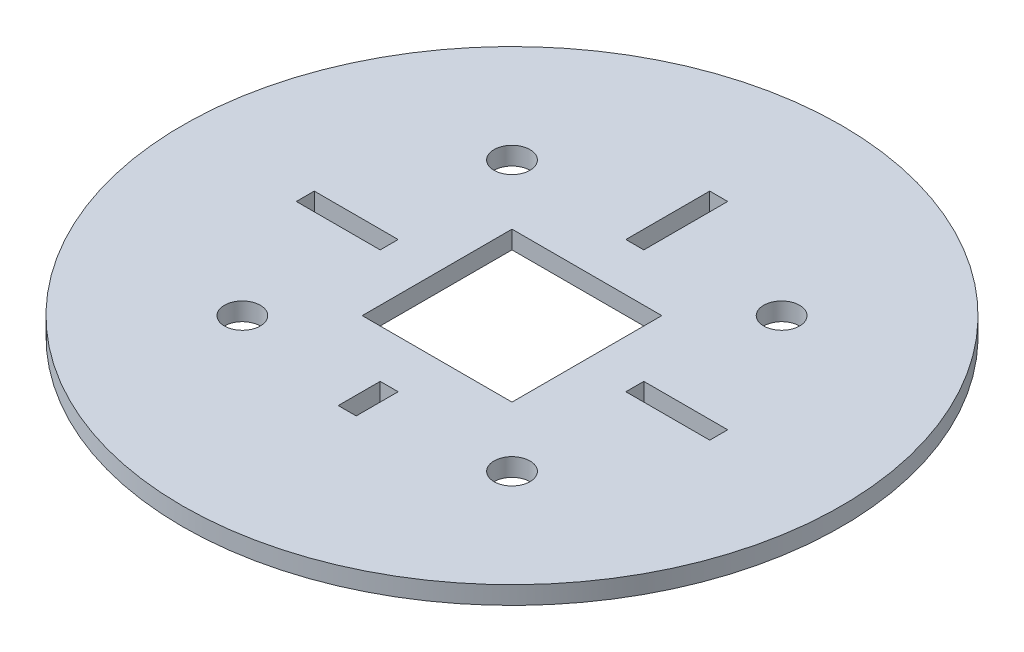
ISO-10303-21;
HEADER;
FILE_DESCRIPTION(('STEP AP214'),'2;1');
FILE_NAME('part.step','',(''),(''),'','','');
FILE_SCHEMA(('AUTOMOTIVE_DESIGN { 1 0 10303 214 1 1 1 1 }'));
ENDSEC;
DATA;
#1=APPLICATION_CONTEXT('core data for automotive mechanical design processes');
#2=APPLICATION_PROTOCOL_DEFINITION('international standard','automotive_design',2000,#1);
#3=PRODUCT_CONTEXT('',#1,'mechanical');
#4=PRODUCT('Part','Part','',(#3));
#5=PRODUCT_RELATED_PRODUCT_CATEGORY('part','',(#4));
#6=PRODUCT_DEFINITION_FORMATION('','',#4);
#7=PRODUCT_DEFINITION_CONTEXT('part definition',#1,'design');
#8=PRODUCT_DEFINITION('design','',#6,#7);
#9=PRODUCT_DEFINITION_SHAPE('','',#8);
#10=(LENGTH_UNIT() NAMED_UNIT(*) SI_UNIT(.MILLI.,.METRE.));
#11=(NAMED_UNIT(*) PLANE_ANGLE_UNIT() SI_UNIT($,.RADIAN.));
#12=(NAMED_UNIT(*) SI_UNIT($,.STERADIAN.) SOLID_ANGLE_UNIT());
#13=UNCERTAINTY_MEASURE_WITH_UNIT(LENGTH_MEASURE(1.E-05),#10,'distance_accuracy_value','');
#14=(GEOMETRIC_REPRESENTATION_CONTEXT(3) GLOBAL_UNCERTAINTY_ASSIGNED_CONTEXT((#13)) GLOBAL_UNIT_ASSIGNED_CONTEXT((#10,
#11,#12)) REPRESENTATION_CONTEXT('',''));
#15=CARTESIAN_POINT('',(0.,0.,0.));
#16=DIRECTION('',(0.,0.,1.));
#17=DIRECTION('',(1.,0.,0.));
#18=AXIS2_PLACEMENT_3D('',#15,#16,#17);
#19=CARTESIAN_POINT('',(0.,3.,0.));
#20=DIRECTION('',(0.,-1.,0.));
#21=DIRECTION('',(0.,0.,-1.));
#22=AXIS2_PLACEMENT_3D('',#19,#20,#21);
#23=CYLINDRICAL_SURFACE('',#22,55.);
#24=CARTESIAN_POINT('',(0.,3.,0.));
#25=DIRECTION('',(0.,1.,0.));
#26=DIRECTION('',(0.,0.,1.));
#27=AXIS2_PLACEMENT_3D('',#24,#25,#26);
#28=CIRCLE('',#27,55.);
#29=CARTESIAN_POINT('',(0.,3.,55.));
#30=VERTEX_POINT('',#29);
#31=EDGE_CURVE('E11',#30,#30,#28,.T.);
#32=ORIENTED_EDGE('',*,*,#31,.F.);
#33=EDGE_LOOP('',(#32));
#34=FACE_BOUND('',#33,.T.);
#35=CARTESIAN_POINT('',(0.,0.,0.));
#36=DIRECTION('',(0.,1.,0.));
#37=DIRECTION('',(0.,0.,1.));
#38=AXIS2_PLACEMENT_3D('',#35,#36,#37);
#39=CIRCLE('',#38,55.);
#40=CARTESIAN_POINT('',(0.,0.,55.));
#41=VERTEX_POINT('',#40);
#42=EDGE_CURVE('E35',#41,#41,#39,.T.);
#43=ORIENTED_EDGE('',*,*,#42,.T.);
#44=EDGE_LOOP('',(#43));
#45=FACE_BOUND('',#44,.T.);
#46=ADVANCED_FACE('F32',(#34,#45),#23,.T.);
#47=CARTESIAN_POINT('',(0.,3.,0.));
#48=DIRECTION('',(0.,1.,0.));
#49=DIRECTION('',(0.,0.,1.));
#50=AXIS2_PLACEMENT_3D('',#47,#48,#49);
#51=PLANE('',#50);
#52=CARTESIAN_POINT('',(-22.5,3.,22.5));
#53=DIRECTION('',(0.,1.,0.));
#54=DIRECTION('',(0.,0.,-1.));
#55=AXIS2_PLACEMENT_3D('',#52,#53,#54);
#56=CIRCLE('',#55,3.);
#57=CARTESIAN_POINT('',(-22.5,3.,19.5));
#58=VERTEX_POINT('',#57);
#59=EDGE_CURVE('E223',#58,#58,#56,.T.);
#60=ORIENTED_EDGE('',*,*,#59,.F.);
#61=EDGE_LOOP('',(#60));
#62=FACE_BOUND('',#61,.T.);
#63=CARTESIAN_POINT('',(22.5,3.,22.5));
#64=DIRECTION('',(0.,1.,0.));
#65=DIRECTION('',(0.,0.,1.));
#66=AXIS2_PLACEMENT_3D('',#63,#64,#65);
#67=CIRCLE('',#66,3.);
#68=CARTESIAN_POINT('',(22.5,3.,25.5));
#69=VERTEX_POINT('',#68);
#70=EDGE_CURVE('E217',#69,#69,#67,.T.);
#71=ORIENTED_EDGE('',*,*,#70,.F.);
#72=EDGE_LOOP('',(#71));
#73=FACE_BOUND('',#72,.T.);
#74=CARTESIAN_POINT('',(22.5,3.,-22.5));
#75=DIRECTION('',(0.,1.,0.));
#76=DIRECTION('',(0.,0.,-1.));
#77=AXIS2_PLACEMENT_3D('',#74,#75,#76);
#78=CIRCLE('',#77,3.);
#79=CARTESIAN_POINT('',(22.5,3.,-25.5));
#80=VERTEX_POINT('',#79);
#81=EDGE_CURVE('E211',#80,#80,#78,.T.);
#82=ORIENTED_EDGE('',*,*,#81,.F.);
#83=EDGE_LOOP('',(#82));
#84=FACE_BOUND('',#83,.T.);
#85=DIRECTION('',(0.,0.,-1.));
#86=VECTOR('',#85,1.);
#87=CARTESIAN_POINT('',(34.5,3.,-1.5));
#88=LINE('',#87,#86);
#89=CARTESIAN_POINT('',(34.5,3.,1.5));
#90=VERTEX_POINT('',#89);
#91=CARTESIAN_POINT('',(34.5,3.,-1.5));
#92=VERTEX_POINT('',#91);
#93=EDGE_CURVE('E46',#90,#92,#88,.T.);
#94=ORIENTED_EDGE('',*,*,#93,.F.);
#95=DIRECTION('',(1.,0.,0.));
#96=VECTOR('',#95,1.);
#97=CARTESIAN_POINT('',(20.5,3.,1.5));
#98=LINE('',#97,#96);
#99=CARTESIAN_POINT('',(20.5,3.,1.5));
#100=VERTEX_POINT('',#99);
#101=EDGE_CURVE('E189',#100,#90,#98,.T.);
#102=ORIENTED_EDGE('',*,*,#101,.F.);
#103=DIRECTION('',(0.,0.,1.));
#104=VECTOR('',#103,1.);
#105=CARTESIAN_POINT('',(20.5,3.,-1.5));
#106=LINE('',#105,#104);
#107=CARTESIAN_POINT('',(20.5,3.,-1.5));
#108=VERTEX_POINT('',#107);
#109=EDGE_CURVE('E192',#108,#100,#106,.T.);
#110=ORIENTED_EDGE('',*,*,#109,.F.);
#111=DIRECTION('',(-1.,0.,0.));
#112=VECTOR('',#111,1.);
#113=CARTESIAN_POINT('',(20.5,3.,-1.5));
#114=LINE('',#113,#112);
#115=EDGE_CURVE('E198',#92,#108,#114,.T.);
#116=ORIENTED_EDGE('',*,*,#115,.F.);
#117=EDGE_LOOP('',(#94,#102,#110,#116));
#118=FACE_BOUND('',#117,.T.);
#119=DIRECTION('',(0.,0.,1.));
#120=VECTOR('',#119,1.);
#121=CARTESIAN_POINT('',(-12.5,3.,-12.5));
#122=LINE('',#121,#120);
#123=CARTESIAN_POINT('',(-12.5,3.,-12.5));
#124=VERTEX_POINT('',#123);
#125=CARTESIAN_POINT('',(-12.5,3.,12.5));
#126=VERTEX_POINT('',#125);
#127=EDGE_CURVE('E54',#124,#126,#122,.T.);
#128=ORIENTED_EDGE('',*,*,#127,.F.);
#129=DIRECTION('',(-1.,0.,0.));
#130=VECTOR('',#129,1.);
#131=CARTESIAN_POINT('',(12.5,3.,-12.5));
#132=LINE('',#131,#130);
#133=CARTESIAN_POINT('',(12.5,3.,-12.5));
#134=VERTEX_POINT('',#133);
#135=EDGE_CURVE('E294',#134,#124,#132,.T.);
#136=ORIENTED_EDGE('',*,*,#135,.F.);
#137=DIRECTION('',(0.,0.,-1.));
#138=VECTOR('',#137,1.);
#139=CARTESIAN_POINT('',(12.5,3.,-12.5));
#140=LINE('',#139,#138);
#141=CARTESIAN_POINT('',(12.5,3.,12.5));
#142=VERTEX_POINT('',#141);
#143=EDGE_CURVE('E309',#142,#134,#140,.T.);
#144=ORIENTED_EDGE('',*,*,#143,.F.);
#145=DIRECTION('',(1.,0.,0.));
#146=VECTOR('',#145,1.);
#147=CARTESIAN_POINT('',(12.5,3.,12.5));
#148=LINE('',#147,#146);
#149=EDGE_CURVE('E305',#126,#142,#148,.T.);
#150=ORIENTED_EDGE('',*,*,#149,.F.);
#151=EDGE_LOOP('',(#128,#136,#144,#150));
#152=FACE_BOUND('',#151,.T.);
#153=CARTESIAN_POINT('',(-22.5,3.,-22.5));
#154=DIRECTION('',(0.,1.,0.));
#155=DIRECTION('',(0.,0.,1.));
#156=AXIS2_PLACEMENT_3D('',#153,#154,#155);
#157=CIRCLE('',#156,3.);
#158=CARTESIAN_POINT('',(-22.5,3.,-19.5));
#159=VERTEX_POINT('',#158);
#160=EDGE_CURVE('E253',#159,#159,#157,.T.);
#161=ORIENTED_EDGE('',*,*,#160,.F.);
#162=EDGE_LOOP('',(#161));
#163=FACE_BOUND('',#162,.T.);
#164=DIRECTION('',(0.,0.,-1.));
#165=VECTOR('',#164,1.);
#166=CARTESIAN_POINT('',(1.49999999999998,3.,20.5));
#167=LINE('',#166,#165);
#168=CARTESIAN_POINT('',(1.49999999999998,3.,27.5));
#169=VERTEX_POINT('',#168);
#170=CARTESIAN_POINT('',(1.49999999999998,3.,20.5));
#171=VERTEX_POINT('',#170);
#172=EDGE_CURVE('E240',#169,#171,#167,.T.);
#173=ORIENTED_EDGE('',*,*,#172,.F.);
#174=DIRECTION('',(1.,0.,0.));
#175=VECTOR('',#174,1.);
#176=CARTESIAN_POINT('',(-1.49999999999998,3.,27.5));
#177=LINE('',#176,#175);
#178=CARTESIAN_POINT('',(-1.49999999999998,3.,27.5));
#179=VERTEX_POINT('',#178);
#180=EDGE_CURVE('E230',#179,#169,#177,.T.);
#181=ORIENTED_EDGE('',*,*,#180,.F.);
#182=DIRECTION('',(0.,0.,1.));
#183=VECTOR('',#182,1.);
#184=CARTESIAN_POINT('',(-1.49999999999998,3.,20.5));
#185=LINE('',#184,#183);
#186=CARTESIAN_POINT('',(-1.49999999999998,3.,20.5));
#187=VERTEX_POINT('',#186);
#188=EDGE_CURVE('E246',#187,#179,#185,.T.);
#189=ORIENTED_EDGE('',*,*,#188,.F.);
#190=DIRECTION('',(-1.,0.,0.));
#191=VECTOR('',#190,1.);
#192=CARTESIAN_POINT('',(-1.49999999999998,3.,20.5));
#193=LINE('',#192,#191);
#194=EDGE_CURVE('E242',#171,#187,#193,.T.);
#195=ORIENTED_EDGE('',*,*,#194,.F.);
#196=EDGE_LOOP('',(#173,#181,#189,#195));
#197=FACE_BOUND('',#196,.T.);
#198=DIRECTION('',(0.,0.,-1.));
#199=VECTOR('',#198,1.);
#200=CARTESIAN_POINT('',(-20.5,3.,-1.5));
#201=LINE('',#200,#199);
#202=CARTESIAN_POINT('',(-20.5,3.,1.49999999999999));
#203=VERTEX_POINT('',#202);
#204=CARTESIAN_POINT('',(-20.5,3.,-1.5));
#205=VERTEX_POINT('',#204);
#206=EDGE_CURVE('E205',#203,#205,#201,.T.);
#207=ORIENTED_EDGE('',*,*,#206,.F.);
#208=DIRECTION('',(1.,0.,0.));
#209=VECTOR('',#208,1.);
#210=CARTESIAN_POINT('',(-34.5,3.,1.49999999999999));
#211=LINE('',#210,#209);
#212=CARTESIAN_POINT('',(-34.5,3.,1.49999999999999));
#213=VERTEX_POINT('',#212);
#214=EDGE_CURVE('E264',#213,#203,#211,.T.);
#215=ORIENTED_EDGE('',*,*,#214,.F.);
#216=DIRECTION('',(0.,0.,1.));
#217=VECTOR('',#216,1.);
#218=CARTESIAN_POINT('',(-34.5,3.,-1.5));
#219=LINE('',#218,#217);
#220=CARTESIAN_POINT('',(-34.5,3.,-1.5));
#221=VERTEX_POINT('',#220);
#222=EDGE_CURVE('E278',#221,#213,#219,.T.);
#223=ORIENTED_EDGE('',*,*,#222,.F.);
#224=DIRECTION('',(-1.,0.,0.));
#225=VECTOR('',#224,1.);
#226=CARTESIAN_POINT('',(-34.5,3.,-1.5));
#227=LINE('',#226,#225);
#228=EDGE_CURVE('E275',#205,#221,#227,.T.);
#229=ORIENTED_EDGE('',*,*,#228,.F.);
#230=EDGE_LOOP('',(#207,#215,#223,#229));
#231=FACE_BOUND('',#230,.T.);
#232=DIRECTION('',(-1.,0.,0.));
#233=VECTOR('',#232,1.);
#234=CARTESIAN_POINT('',(-1.50000000000001,3.,-34.5));
#235=LINE('',#234,#233);
#236=CARTESIAN_POINT('',(1.49999999999998,3.,-34.5));
#237=VERTEX_POINT('',#236);
#238=CARTESIAN_POINT('',(-1.50000000000001,3.,-34.5));
#239=VERTEX_POINT('',#238);
#240=EDGE_CURVE('E316',#237,#239,#235,.T.);
#241=ORIENTED_EDGE('',*,*,#240,.F.);
#242=DIRECTION('',(0.,0.,-1.));
#243=VECTOR('',#242,1.);
#244=CARTESIAN_POINT('',(1.49999999999998,3.,-34.5));
#245=LINE('',#244,#243);
#246=CARTESIAN_POINT('',(1.49999999999998,3.,-20.5));
#247=VERTEX_POINT('',#246);
#248=EDGE_CURVE('E330',#247,#237,#245,.T.);
#249=ORIENTED_EDGE('',*,*,#248,.F.);
#250=DIRECTION('',(1.,0.,0.));
#251=VECTOR('',#250,1.);
#252=CARTESIAN_POINT('',(-1.50000000000001,3.,-20.5));
#253=LINE('',#252,#251);
#254=CARTESIAN_POINT('',(-1.50000000000001,3.,-20.5));
#255=VERTEX_POINT('',#254);
#256=EDGE_CURVE('E344',#255,#247,#253,.T.);
#257=ORIENTED_EDGE('',*,*,#256,.F.);
#258=DIRECTION('',(0.,0.,1.));
#259=VECTOR('',#258,1.);
#260=CARTESIAN_POINT('',(-1.50000000000001,3.,-34.5));
#261=LINE('',#260,#259);
#262=EDGE_CURVE('E341',#239,#255,#261,.T.);
#263=ORIENTED_EDGE('',*,*,#262,.F.);
#264=EDGE_LOOP('',(#241,#249,#257,#263));
#265=FACE_BOUND('',#264,.T.);
#266=ORIENTED_EDGE('',*,*,#31,.T.);
#267=EDGE_LOOP('',(#266));
#268=FACE_BOUND('',#267,.T.);
#269=ADVANCED_FACE('F366',(#62,#73,#84,#118,#152,#163,#197,#231,#265,#268),#51,.T.);
#270=CARTESIAN_POINT('',(0.,0.,0.));
#271=DIRECTION('',(0.,1.,0.));
#272=DIRECTION('',(0.,0.,1.));
#273=AXIS2_PLACEMENT_3D('',#270,#271,#272);
#274=PLANE('',#273);
#275=CARTESIAN_POINT('',(-22.5,0.,22.5));
#276=DIRECTION('',(0.,1.,0.));
#277=DIRECTION('',(0.,0.,-1.));
#278=AXIS2_PLACEMENT_3D('',#275,#276,#277);
#279=CIRCLE('',#278,3.);
#280=CARTESIAN_POINT('',(-22.5,0.,19.5));
#281=VERTEX_POINT('',#280);
#282=EDGE_CURVE('E220',#281,#281,#279,.T.);
#283=ORIENTED_EDGE('',*,*,#282,.T.);
#284=EDGE_LOOP('',(#283));
#285=FACE_BOUND('',#284,.T.);
#286=CARTESIAN_POINT('',(22.5,0.,22.5));
#287=DIRECTION('',(0.,1.,0.));
#288=DIRECTION('',(0.,0.,1.));
#289=AXIS2_PLACEMENT_3D('',#286,#287,#288);
#290=CIRCLE('',#289,3.);
#291=CARTESIAN_POINT('',(22.5,0.,25.5));
#292=VERTEX_POINT('',#291);
#293=EDGE_CURVE('E214',#292,#292,#290,.T.);
#294=ORIENTED_EDGE('',*,*,#293,.T.);
#295=EDGE_LOOP('',(#294));
#296=FACE_BOUND('',#295,.T.);
#297=CARTESIAN_POINT('',(22.5,0.,-22.5));
#298=DIRECTION('',(0.,1.,0.));
#299=DIRECTION('',(0.,0.,-1.));
#300=AXIS2_PLACEMENT_3D('',#297,#298,#299);
#301=CIRCLE('',#300,3.);
#302=CARTESIAN_POINT('',(22.5,0.,-25.5));
#303=VERTEX_POINT('',#302);
#304=EDGE_CURVE('E199',#303,#303,#301,.T.);
#305=ORIENTED_EDGE('',*,*,#304,.T.);
#306=EDGE_LOOP('',(#305));
#307=FACE_BOUND('',#306,.T.);
#308=DIRECTION('',(1.,0.,0.));
#309=VECTOR('',#308,1.);
#310=CARTESIAN_POINT('',(20.5,0.,1.5));
#311=LINE('',#310,#309);
#312=CARTESIAN_POINT('',(20.5,0.,1.5));
#313=VERTEX_POINT('',#312);
#314=CARTESIAN_POINT('',(34.5,0.,1.5));
#315=VERTEX_POINT('',#314);
#316=EDGE_CURVE('E176',#313,#315,#311,.T.);
#317=ORIENTED_EDGE('',*,*,#316,.T.);
#318=DIRECTION('',(0.,0.,-1.));
#319=VECTOR('',#318,1.);
#320=CARTESIAN_POINT('',(34.5,0.,-1.5));
#321=LINE('',#320,#319);
#322=CARTESIAN_POINT('',(34.5,0.,-1.5));
#323=VERTEX_POINT('',#322);
#324=EDGE_CURVE('E170',#315,#323,#321,.T.);
#325=ORIENTED_EDGE('',*,*,#324,.T.);
#326=DIRECTION('',(-1.,0.,0.));
#327=VECTOR('',#326,1.);
#328=CARTESIAN_POINT('',(20.5,0.,-1.5));
#329=LINE('',#328,#327);
#330=CARTESIAN_POINT('',(20.5,0.,-1.5));
#331=VERTEX_POINT('',#330);
#332=EDGE_CURVE('E180',#323,#331,#329,.T.);
#333=ORIENTED_EDGE('',*,*,#332,.T.);
#334=DIRECTION('',(0.,0.,1.));
#335=VECTOR('',#334,1.);
#336=CARTESIAN_POINT('',(20.5,0.,-1.5));
#337=LINE('',#336,#335);
#338=EDGE_CURVE('E184',#331,#313,#337,.T.);
#339=ORIENTED_EDGE('',*,*,#338,.T.);
#340=EDGE_LOOP('',(#317,#325,#333,#339));
#341=FACE_BOUND('',#340,.T.);
#342=DIRECTION('',(-1.,0.,0.));
#343=VECTOR('',#342,1.);
#344=CARTESIAN_POINT('',(12.5,0.,-12.5));
#345=LINE('',#344,#343);
#346=CARTESIAN_POINT('',(12.5,0.,-12.5));
#347=VERTEX_POINT('',#346);
#348=CARTESIAN_POINT('',(-12.5,0.,-12.5));
#349=VERTEX_POINT('',#348);
#350=EDGE_CURVE('E300',#347,#349,#345,.T.);
#351=ORIENTED_EDGE('',*,*,#350,.T.);
#352=DIRECTION('',(0.,0.,1.));
#353=VECTOR('',#352,1.);
#354=CARTESIAN_POINT('',(-12.5,0.,-12.5));
#355=LINE('',#354,#353);
#356=CARTESIAN_POINT('',(-12.5,0.,12.5));
#357=VERTEX_POINT('',#356);
#358=EDGE_CURVE('E290',#349,#357,#355,.T.);
#359=ORIENTED_EDGE('',*,*,#358,.T.);
#360=DIRECTION('',(1.,0.,0.));
#361=VECTOR('',#360,1.);
#362=CARTESIAN_POINT('',(12.5,0.,12.5));
#363=LINE('',#362,#361);
#364=CARTESIAN_POINT('',(12.5,0.,12.5));
#365=VERTEX_POINT('',#364);
#366=EDGE_CURVE('E293',#357,#365,#363,.T.);
#367=ORIENTED_EDGE('',*,*,#366,.T.);
#368=DIRECTION('',(0.,0.,-1.));
#369=VECTOR('',#368,1.);
#370=CARTESIAN_POINT('',(12.5,0.,-12.5));
#371=LINE('',#370,#369);
#372=EDGE_CURVE('E297',#365,#347,#371,.T.);
#373=ORIENTED_EDGE('',*,*,#372,.T.);
#374=EDGE_LOOP('',(#351,#359,#367,#373));
#375=FACE_BOUND('',#374,.T.);
#376=CARTESIAN_POINT('',(-22.5,0.,-22.5));
#377=DIRECTION('',(0.,1.,0.));
#378=DIRECTION('',(0.,0.,1.));
#379=AXIS2_PLACEMENT_3D('',#376,#377,#378);
#380=CIRCLE('',#379,3.);
#381=CARTESIAN_POINT('',(-22.5,0.,-19.5));
#382=VERTEX_POINT('',#381);
#383=EDGE_CURVE('E306',#382,#382,#380,.T.);
#384=ORIENTED_EDGE('',*,*,#383,.T.);
#385=EDGE_LOOP('',(#384));
#386=FACE_BOUND('',#385,.T.);
#387=DIRECTION('',(1.,0.,0.));
#388=VECTOR('',#387,1.);
#389=CARTESIAN_POINT('',(-1.49999999999998,0.,27.5));
#390=LINE('',#389,#388);
#391=CARTESIAN_POINT('',(-1.49999999999998,0.,27.5));
#392=VERTEX_POINT('',#391);
#393=CARTESIAN_POINT('',(1.49999999999998,0.,27.5));
#394=VERTEX_POINT('',#393);
#395=EDGE_CURVE('E236',#392,#394,#390,.T.);
#396=ORIENTED_EDGE('',*,*,#395,.T.);
#397=DIRECTION('',(0.,0.,-1.));
#398=VECTOR('',#397,1.);
#399=CARTESIAN_POINT('',(1.49999999999998,0.,20.5));
#400=LINE('',#399,#398);
#401=CARTESIAN_POINT('',(1.49999999999998,0.,20.5));
#402=VERTEX_POINT('',#401);
#403=EDGE_CURVE('E226',#394,#402,#400,.T.);
#404=ORIENTED_EDGE('',*,*,#403,.T.);
#405=DIRECTION('',(-1.,0.,0.));
#406=VECTOR('',#405,1.);
#407=CARTESIAN_POINT('',(-1.49999999999998,0.,20.5));
#408=LINE('',#407,#406);
#409=CARTESIAN_POINT('',(-1.49999999999998,0.,20.5));
#410=VERTEX_POINT('',#409);
#411=EDGE_CURVE('E229',#402,#410,#408,.T.);
#412=ORIENTED_EDGE('',*,*,#411,.T.);
#413=DIRECTION('',(0.,0.,1.));
#414=VECTOR('',#413,1.);
#415=CARTESIAN_POINT('',(-1.49999999999998,0.,20.5));
#416=LINE('',#415,#414);
#417=EDGE_CURVE('E233',#410,#392,#416,.T.);
#418=ORIENTED_EDGE('',*,*,#417,.T.);
#419=EDGE_LOOP('',(#396,#404,#412,#418));
#420=FACE_BOUND('',#419,.T.);
#421=DIRECTION('',(1.,0.,0.));
#422=VECTOR('',#421,1.);
#423=CARTESIAN_POINT('',(-34.5,0.,1.49999999999999));
#424=LINE('',#423,#422);
#425=CARTESIAN_POINT('',(-34.5,0.,1.49999999999999));
#426=VERTEX_POINT('',#425);
#427=CARTESIAN_POINT('',(-20.5,0.,1.49999999999999));
#428=VERTEX_POINT('',#427);
#429=EDGE_CURVE('E270',#426,#428,#424,.T.);
#430=ORIENTED_EDGE('',*,*,#429,.T.);
#431=DIRECTION('',(0.,0.,-1.));
#432=VECTOR('',#431,1.);
#433=CARTESIAN_POINT('',(-20.5,0.,-1.5));
#434=LINE('',#433,#432);
#435=CARTESIAN_POINT('',(-20.5,0.,-1.5));
#436=VERTEX_POINT('',#435);
#437=EDGE_CURVE('E260',#428,#436,#434,.T.);
#438=ORIENTED_EDGE('',*,*,#437,.T.);
#439=DIRECTION('',(-1.,0.,0.));
#440=VECTOR('',#439,1.);
#441=CARTESIAN_POINT('',(-34.5,0.,-1.5));
#442=LINE('',#441,#440);
#443=CARTESIAN_POINT('',(-34.5,0.,-1.5));
#444=VERTEX_POINT('',#443);
#445=EDGE_CURVE('E263',#436,#444,#442,.T.);
#446=ORIENTED_EDGE('',*,*,#445,.T.);
#447=DIRECTION('',(0.,0.,1.));
#448=VECTOR('',#447,1.);
#449=CARTESIAN_POINT('',(-34.5,0.,-1.5));
#450=LINE('',#449,#448);
#451=EDGE_CURVE('E267',#444,#426,#450,.T.);
#452=ORIENTED_EDGE('',*,*,#451,.T.);
#453=EDGE_LOOP('',(#430,#438,#446,#452));
#454=FACE_BOUND('',#453,.T.);
#455=DIRECTION('',(0.,0.,-1.));
#456=VECTOR('',#455,1.);
#457=CARTESIAN_POINT('',(1.49999999999998,0.,-34.5));
#458=LINE('',#457,#456);
#459=CARTESIAN_POINT('',(1.49999999999998,0.,-20.5));
#460=VERTEX_POINT('',#459);
#461=CARTESIAN_POINT('',(1.49999999999998,0.,-34.5));
#462=VERTEX_POINT('',#461);
#463=EDGE_CURVE('E336',#460,#462,#458,.T.);
#464=ORIENTED_EDGE('',*,*,#463,.T.);
#465=DIRECTION('',(-1.,0.,0.));
#466=VECTOR('',#465,1.);
#467=CARTESIAN_POINT('',(-1.50000000000001,0.,-34.5));
#468=LINE('',#467,#466);
#469=CARTESIAN_POINT('',(-1.50000000000001,0.,-34.5));
#470=VERTEX_POINT('',#469);
#471=EDGE_CURVE('E326',#462,#470,#468,.T.);
#472=ORIENTED_EDGE('',*,*,#471,.T.);
#473=DIRECTION('',(0.,0.,1.));
#474=VECTOR('',#473,1.);
#475=CARTESIAN_POINT('',(-1.50000000000001,0.,-34.5));
#476=LINE('',#475,#474);
#477=CARTESIAN_POINT('',(-1.50000000000001,0.,-20.5));
#478=VERTEX_POINT('',#477);
#479=EDGE_CURVE('E329',#470,#478,#476,.T.);
#480=ORIENTED_EDGE('',*,*,#479,.T.);
#481=DIRECTION('',(1.,0.,0.));
#482=VECTOR('',#481,1.);
#483=CARTESIAN_POINT('',(-1.50000000000001,0.,-20.5));
#484=LINE('',#483,#482);
#485=EDGE_CURVE('E333',#478,#460,#484,.T.);
#486=ORIENTED_EDGE('',*,*,#485,.T.);
#487=EDGE_LOOP('',(#464,#472,#480,#486));
#488=FACE_BOUND('',#487,.T.);
#489=ORIENTED_EDGE('',*,*,#42,.F.);
#490=EDGE_LOOP('',(#489));
#491=FACE_BOUND('',#490,.T.);
#492=ADVANCED_FACE('F186',(#285,#296,#307,#341,#375,#386,#420,#454,#488,#491),#274,.F.);
#493=CARTESIAN_POINT('',(-1.50000000000001,0.,-34.5));
#494=DIRECTION('',(0.,0.,-1.));
#495=DIRECTION('',(-1.,0.,0.));
#496=AXIS2_PLACEMENT_3D('',#493,#494,#495);
#497=PLANE('',#496);
#498=ORIENTED_EDGE('',*,*,#240,.T.);
#499=DIRECTION('',(0.,1.,0.));
#500=VECTOR('',#499,1.);
#501=CARTESIAN_POINT('',(-1.50000000000001,0.,-34.5));
#502=LINE('',#501,#500);
#503=EDGE_CURVE('E339',#470,#239,#502,.T.);
#504=ORIENTED_EDGE('',*,*,#503,.F.);
#505=ORIENTED_EDGE('',*,*,#471,.F.);
#506=DIRECTION('',(0.,1.,0.));
#507=VECTOR('',#506,1.);
#508=CARTESIAN_POINT('',(1.49999999999998,0.,-34.5));
#509=LINE('',#508,#507);
#510=EDGE_CURVE('E349',#462,#237,#509,.T.);
#511=ORIENTED_EDGE('',*,*,#510,.T.);
#512=EDGE_LOOP('',(#498,#504,#505,#511));
#513=FACE_BOUND('',#512,.T.);
#514=ADVANCED_FACE('F374',(#513),#497,.F.);
#515=CARTESIAN_POINT('',(1.49999999999998,0.,-34.5));
#516=DIRECTION('',(1.,0.,0.));
#517=DIRECTION('',(0.,0.,-1.));
#518=AXIS2_PLACEMENT_3D('',#515,#516,#517);
#519=PLANE('',#518);
#520=ORIENTED_EDGE('',*,*,#248,.T.);
#521=ORIENTED_EDGE('',*,*,#510,.F.);
#522=ORIENTED_EDGE('',*,*,#463,.F.);
#523=DIRECTION('',(0.,1.,0.));
#524=VECTOR('',#523,1.);
#525=CARTESIAN_POINT('',(1.49999999999998,0.,-20.5));
#526=LINE('',#525,#524);
#527=EDGE_CURVE('E351',#460,#247,#526,.T.);
#528=ORIENTED_EDGE('',*,*,#527,.T.);
#529=EDGE_LOOP('',(#520,#521,#522,#528));
#530=FACE_BOUND('',#529,.T.);
#531=ADVANCED_FACE('F376',(#530),#519,.F.);
#532=CARTESIAN_POINT('',(-1.50000000000001,0.,-20.5));
#533=DIRECTION('',(0.,0.,1.));
#534=DIRECTION('',(1.,0.,0.));
#535=AXIS2_PLACEMENT_3D('',#532,#533,#534);
#536=PLANE('',#535);
#537=ORIENTED_EDGE('',*,*,#256,.T.);
#538=ORIENTED_EDGE('',*,*,#527,.F.);
#539=ORIENTED_EDGE('',*,*,#485,.F.);
#540=DIRECTION('',(0.,1.,0.));
#541=VECTOR('',#540,1.);
#542=CARTESIAN_POINT('',(-1.50000000000001,0.,-20.5));
#543=LINE('',#542,#541);
#544=EDGE_CURVE('E353',#478,#255,#543,.T.);
#545=ORIENTED_EDGE('',*,*,#544,.T.);
#546=EDGE_LOOP('',(#537,#538,#539,#545));
#547=FACE_BOUND('',#546,.T.);
#548=ADVANCED_FACE('F370',(#547),#536,.F.);
#549=CARTESIAN_POINT('',(-1.50000000000001,0.,-34.5));
#550=DIRECTION('',(-1.,0.,0.));
#551=DIRECTION('',(0.,0.,1.));
#552=AXIS2_PLACEMENT_3D('',#549,#550,#551);
#553=PLANE('',#552);
#554=ORIENTED_EDGE('',*,*,#262,.T.);
#555=ORIENTED_EDGE('',*,*,#544,.F.);
#556=ORIENTED_EDGE('',*,*,#479,.F.);
#557=ORIENTED_EDGE('',*,*,#503,.T.);
#558=EDGE_LOOP('',(#554,#555,#556,#557));
#559=FACE_BOUND('',#558,.T.);
#560=ADVANCED_FACE('F359',(#559),#553,.F.);
#561=CARTESIAN_POINT('',(-20.5,0.,-1.5));
#562=DIRECTION('',(1.,0.,0.));
#563=DIRECTION('',(0.,0.,-1.));
#564=AXIS2_PLACEMENT_3D('',#561,#562,#563);
#565=PLANE('',#564);
#566=ORIENTED_EDGE('',*,*,#206,.T.);
#567=DIRECTION('',(0.,1.,0.));
#568=VECTOR('',#567,1.);
#569=CARTESIAN_POINT('',(-20.5,0.,-1.5));
#570=LINE('',#569,#568);
#571=EDGE_CURVE('E273',#436,#205,#570,.T.);
#572=ORIENTED_EDGE('',*,*,#571,.F.);
#573=ORIENTED_EDGE('',*,*,#437,.F.);
#574=DIRECTION('',(0.,1.,0.));
#575=VECTOR('',#574,1.);
#576=CARTESIAN_POINT('',(-20.5,0.,1.49999999999999));
#577=LINE('',#576,#575);
#578=EDGE_CURVE('E243',#428,#203,#577,.T.);
#579=ORIENTED_EDGE('',*,*,#578,.T.);
#580=EDGE_LOOP('',(#566,#572,#573,#579));
#581=FACE_BOUND('',#580,.T.);
#582=ADVANCED_FACE('F404',(#581),#565,.F.);
#583=CARTESIAN_POINT('',(-34.5,0.,1.49999999999999));
#584=DIRECTION('',(0.,0.,1.));
#585=DIRECTION('',(1.,0.,0.));
#586=AXIS2_PLACEMENT_3D('',#583,#584,#585);
#587=PLANE('',#586);
#588=ORIENTED_EDGE('',*,*,#214,.T.);
#589=ORIENTED_EDGE('',*,*,#578,.F.);
#590=ORIENTED_EDGE('',*,*,#429,.F.);
#591=DIRECTION('',(0.,1.,0.));
#592=VECTOR('',#591,1.);
#593=CARTESIAN_POINT('',(-34.5,0.,1.49999999999999));
#594=LINE('',#593,#592);
#595=EDGE_CURVE('E284',#426,#213,#594,.T.);
#596=ORIENTED_EDGE('',*,*,#595,.T.);
#597=EDGE_LOOP('',(#588,#589,#590,#596));
#598=FACE_BOUND('',#597,.T.);
#599=ADVANCED_FACE('F408',(#598),#587,.F.);
#600=CARTESIAN_POINT('',(-34.5,0.,-1.5));
#601=DIRECTION('',(-1.,0.,0.));
#602=DIRECTION('',(0.,0.,1.));
#603=AXIS2_PLACEMENT_3D('',#600,#601,#602);
#604=PLANE('',#603);
#605=ORIENTED_EDGE('',*,*,#222,.T.);
#606=ORIENTED_EDGE('',*,*,#595,.F.);
#607=ORIENTED_EDGE('',*,*,#451,.F.);
#608=DIRECTION('',(0.,1.,0.));
#609=VECTOR('',#608,1.);
#610=CARTESIAN_POINT('',(-34.5,0.,-1.5));
#611=LINE('',#610,#609);
#612=EDGE_CURVE('E286',#444,#221,#611,.T.);
#613=ORIENTED_EDGE('',*,*,#612,.T.);
#614=EDGE_LOOP('',(#605,#606,#607,#613));
#615=FACE_BOUND('',#614,.T.);
#616=ADVANCED_FACE('F414',(#615),#604,.F.);
#617=CARTESIAN_POINT('',(-34.5,0.,-1.5));
#618=DIRECTION('',(0.,0.,-1.));
#619=DIRECTION('',(-1.,0.,0.));
#620=AXIS2_PLACEMENT_3D('',#617,#618,#619);
#621=PLANE('',#620);
#622=ORIENTED_EDGE('',*,*,#228,.T.);
#623=ORIENTED_EDGE('',*,*,#612,.F.);
#624=ORIENTED_EDGE('',*,*,#445,.F.);
#625=ORIENTED_EDGE('',*,*,#571,.T.);
#626=EDGE_LOOP('',(#622,#623,#624,#625));
#627=FACE_BOUND('',#626,.T.);
#628=ADVANCED_FACE('F419',(#627),#621,.F.);
#629=CARTESIAN_POINT('',(1.49999999999998,0.,20.5));
#630=DIRECTION('',(1.,0.,0.));
#631=DIRECTION('',(0.,0.,-1.));
#632=AXIS2_PLACEMENT_3D('',#629,#630,#631);
#633=PLANE('',#632);
#634=ORIENTED_EDGE('',*,*,#172,.T.);
#635=DIRECTION('',(0.,1.,0.));
#636=VECTOR('',#635,1.);
#637=CARTESIAN_POINT('',(1.49999999999998,0.,20.5));
#638=LINE('',#637,#636);
#639=EDGE_CURVE('E239',#402,#171,#638,.T.);
#640=ORIENTED_EDGE('',*,*,#639,.F.);
#641=ORIENTED_EDGE('',*,*,#403,.F.);
#642=DIRECTION('',(0.,1.,0.));
#643=VECTOR('',#642,1.);
#644=CARTESIAN_POINT('',(1.49999999999998,0.,27.5));
#645=LINE('',#644,#643);
#646=EDGE_CURVE('E251',#394,#169,#645,.T.);
#647=ORIENTED_EDGE('',*,*,#646,.T.);
#648=EDGE_LOOP('',(#634,#640,#641,#647));
#649=FACE_BOUND('',#648,.T.);
#650=ADVANCED_FACE('F469',(#649),#633,.F.);
#651=CARTESIAN_POINT('',(-1.49999999999998,0.,27.5));
#652=DIRECTION('',(0.,0.,1.));
#653=DIRECTION('',(1.,0.,0.));
#654=AXIS2_PLACEMENT_3D('',#651,#652,#653);
#655=PLANE('',#654);
#656=ORIENTED_EDGE('',*,*,#180,.T.);
#657=ORIENTED_EDGE('',*,*,#646,.F.);
#658=ORIENTED_EDGE('',*,*,#395,.F.);
#659=DIRECTION('',(0.,1.,0.));
#660=VECTOR('',#659,1.);
#661=CARTESIAN_POINT('',(-1.49999999999998,0.,27.5));
#662=LINE('',#661,#660);
#663=EDGE_CURVE('E254',#392,#179,#662,.T.);
#664=ORIENTED_EDGE('',*,*,#663,.T.);
#665=EDGE_LOOP('',(#656,#657,#658,#664));
#666=FACE_BOUND('',#665,.T.);
#667=ADVANCED_FACE('F472',(#666),#655,.F.);
#668=CARTESIAN_POINT('',(-1.49999999999998,0.,20.5));
#669=DIRECTION('',(-1.,0.,0.));
#670=DIRECTION('',(0.,0.,1.));
#671=AXIS2_PLACEMENT_3D('',#668,#669,#670);
#672=PLANE('',#671);
#673=ORIENTED_EDGE('',*,*,#188,.T.);
#674=ORIENTED_EDGE('',*,*,#663,.F.);
#675=ORIENTED_EDGE('',*,*,#417,.F.);
#676=DIRECTION('',(0.,1.,0.));
#677=VECTOR('',#676,1.);
#678=CARTESIAN_POINT('',(-1.49999999999998,0.,20.5));
#679=LINE('',#678,#677);
#680=EDGE_CURVE('E256',#410,#187,#679,.T.);
#681=ORIENTED_EDGE('',*,*,#680,.T.);
#682=EDGE_LOOP('',(#673,#674,#675,#681));
#683=FACE_BOUND('',#682,.T.);
#684=ADVANCED_FACE('F442',(#683),#672,.F.);
#685=CARTESIAN_POINT('',(-1.49999999999998,0.,20.5));
#686=DIRECTION('',(0.,0.,-1.));
#687=DIRECTION('',(-1.,0.,0.));
#688=AXIS2_PLACEMENT_3D('',#685,#686,#687);
#689=PLANE('',#688);
#690=ORIENTED_EDGE('',*,*,#194,.T.);
#691=ORIENTED_EDGE('',*,*,#680,.F.);
#692=ORIENTED_EDGE('',*,*,#411,.F.);
#693=ORIENTED_EDGE('',*,*,#639,.T.);
#694=EDGE_LOOP('',(#690,#691,#692,#693));
#695=FACE_BOUND('',#694,.T.);
#696=ADVANCED_FACE('F437',(#695),#689,.F.);
#697=CARTESIAN_POINT('',(-22.5,0.,-22.5));
#698=DIRECTION('',(0.,1.,0.));
#699=DIRECTION('',(0.,0.,1.));
#700=AXIS2_PLACEMENT_3D('',#697,#698,#699);
#701=CYLINDRICAL_SURFACE('',#700,3.);
#702=ORIENTED_EDGE('',*,*,#383,.F.);
#703=EDGE_LOOP('',(#702));
#704=FACE_BOUND('',#703,.T.);
#705=ORIENTED_EDGE('',*,*,#160,.T.);
#706=EDGE_LOOP('',(#705));
#707=FACE_BOUND('',#706,.T.);
#708=ADVANCED_FACE('F435',(#704,#707),#701,.F.);
#709=CARTESIAN_POINT('',(-12.5,0.,-12.5));
#710=DIRECTION('',(-1.,0.,0.));
#711=DIRECTION('',(0.,0.,1.));
#712=AXIS2_PLACEMENT_3D('',#709,#710,#711);
#713=PLANE('',#712);
#714=ORIENTED_EDGE('',*,*,#127,.T.);
#715=DIRECTION('',(0.,1.,0.));
#716=VECTOR('',#715,1.);
#717=CARTESIAN_POINT('',(-12.5,0.,12.5));
#718=LINE('',#717,#716);
#719=EDGE_CURVE('E303',#357,#126,#718,.T.);
#720=ORIENTED_EDGE('',*,*,#719,.F.);
#721=ORIENTED_EDGE('',*,*,#358,.F.);
#722=DIRECTION('',(0.,1.,0.));
#723=VECTOR('',#722,1.);
#724=CARTESIAN_POINT('',(-12.5,0.,-12.5));
#725=LINE('',#724,#723);
#726=EDGE_CURVE('E314',#349,#124,#725,.T.);
#727=ORIENTED_EDGE('',*,*,#726,.T.);
#728=EDGE_LOOP('',(#714,#720,#721,#727));
#729=FACE_BOUND('',#728,.T.);
#730=ADVANCED_FACE('F425',(#729),#713,.F.);
#731=CARTESIAN_POINT('',(12.5,0.,-12.5));
#732=DIRECTION('',(0.,0.,-1.));
#733=DIRECTION('',(-1.,0.,0.));
#734=AXIS2_PLACEMENT_3D('',#731,#732,#733);
#735=PLANE('',#734);
#736=ORIENTED_EDGE('',*,*,#135,.T.);
#737=ORIENTED_EDGE('',*,*,#726,.F.);
#738=ORIENTED_EDGE('',*,*,#350,.F.);
#739=DIRECTION('',(0.,1.,0.));
#740=VECTOR('',#739,1.);
#741=CARTESIAN_POINT('',(12.5,0.,-12.5));
#742=LINE('',#741,#740);
#743=EDGE_CURVE('E317',#347,#134,#742,.T.);
#744=ORIENTED_EDGE('',*,*,#743,.T.);
#745=EDGE_LOOP('',(#736,#737,#738,#744));
#746=FACE_BOUND('',#745,.T.);
#747=ADVANCED_FACE('F421',(#746),#735,.F.);
#748=CARTESIAN_POINT('',(12.5,0.,-12.5));
#749=DIRECTION('',(1.,0.,0.));
#750=DIRECTION('',(0.,0.,-1.));
#751=AXIS2_PLACEMENT_3D('',#748,#749,#750);
#752=PLANE('',#751);
#753=ORIENTED_EDGE('',*,*,#143,.T.);
#754=ORIENTED_EDGE('',*,*,#743,.F.);
#755=ORIENTED_EDGE('',*,*,#372,.F.);
#756=DIRECTION('',(0.,1.,0.));
#757=VECTOR('',#756,1.);
#758=CARTESIAN_POINT('',(12.5,0.,12.5));
#759=LINE('',#758,#757);
#760=EDGE_CURVE('E319',#365,#142,#759,.T.);
#761=ORIENTED_EDGE('',*,*,#760,.T.);
#762=EDGE_LOOP('',(#753,#754,#755,#761));
#763=FACE_BOUND('',#762,.T.);
#764=ADVANCED_FACE('F424',(#763),#752,.F.);
#765=CARTESIAN_POINT('',(12.5,0.,12.5));
#766=DIRECTION('',(0.,0.,1.));
#767=DIRECTION('',(1.,0.,0.));
#768=AXIS2_PLACEMENT_3D('',#765,#766,#767);
#769=PLANE('',#768);
#770=ORIENTED_EDGE('',*,*,#149,.T.);
#771=ORIENTED_EDGE('',*,*,#760,.F.);
#772=ORIENTED_EDGE('',*,*,#366,.F.);
#773=ORIENTED_EDGE('',*,*,#719,.T.);
#774=EDGE_LOOP('',(#770,#771,#772,#773));
#775=FACE_BOUND('',#774,.T.);
#776=ADVANCED_FACE('F429',(#775),#769,.F.);
#777=CARTESIAN_POINT('',(34.5,0.,-1.5));
#778=DIRECTION('',(1.,0.,0.));
#779=DIRECTION('',(0.,0.,-1.));
#780=AXIS2_PLACEMENT_3D('',#777,#778,#779);
#781=PLANE('',#780);
#782=ORIENTED_EDGE('',*,*,#93,.T.);
#783=DIRECTION('',(0.,1.,0.));
#784=VECTOR('',#783,1.);
#785=CARTESIAN_POINT('',(34.5,0.,-1.5));
#786=LINE('',#785,#784);
#787=EDGE_CURVE('E166',#323,#92,#786,.T.);
#788=ORIENTED_EDGE('',*,*,#787,.F.);
#789=ORIENTED_EDGE('',*,*,#324,.F.);
#790=DIRECTION('',(0.,1.,0.));
#791=VECTOR('',#790,1.);
#792=CARTESIAN_POINT('',(34.5,0.,1.5));
#793=LINE('',#792,#791);
#794=EDGE_CURVE('E203',#315,#90,#793,.T.);
#795=ORIENTED_EDGE('',*,*,#794,.T.);
#796=EDGE_LOOP('',(#782,#788,#789,#795));
#797=FACE_BOUND('',#796,.T.);
#798=ADVANCED_FACE('F168',(#797),#781,.F.);
#799=CARTESIAN_POINT('',(20.5,0.,1.5));
#800=DIRECTION('',(0.,0.,1.));
#801=DIRECTION('',(1.,0.,0.));
#802=AXIS2_PLACEMENT_3D('',#799,#800,#801);
#803=PLANE('',#802);
#804=ORIENTED_EDGE('',*,*,#101,.T.);
#805=ORIENTED_EDGE('',*,*,#794,.F.);
#806=ORIENTED_EDGE('',*,*,#316,.F.);
#807=DIRECTION('',(0.,1.,0.));
#808=VECTOR('',#807,1.);
#809=CARTESIAN_POINT('',(20.5,0.,1.5));
#810=LINE('',#809,#808);
#811=EDGE_CURVE('E206',#313,#100,#810,.T.);
#812=ORIENTED_EDGE('',*,*,#811,.T.);
#813=EDGE_LOOP('',(#804,#805,#806,#812));
#814=FACE_BOUND('',#813,.T.);
#815=ADVANCED_FACE('F495',(#814),#803,.F.);
#816=CARTESIAN_POINT('',(20.5,0.,-1.5));
#817=DIRECTION('',(-1.,0.,0.));
#818=DIRECTION('',(0.,0.,1.));
#819=AXIS2_PLACEMENT_3D('',#816,#817,#818);
#820=PLANE('',#819);
#821=ORIENTED_EDGE('',*,*,#109,.T.);
#822=ORIENTED_EDGE('',*,*,#811,.F.);
#823=ORIENTED_EDGE('',*,*,#338,.F.);
#824=DIRECTION('',(0.,1.,0.));
#825=VECTOR('',#824,1.);
#826=CARTESIAN_POINT('',(20.5,0.,-1.5));
#827=LINE('',#826,#825);
#828=EDGE_CURVE('E175',#331,#108,#827,.T.);
#829=ORIENTED_EDGE('',*,*,#828,.T.);
#830=EDGE_LOOP('',(#821,#822,#823,#829));
#831=FACE_BOUND('',#830,.T.);
#832=ADVANCED_FACE('F498',(#831),#820,.F.);
#833=CARTESIAN_POINT('',(20.5,0.,-1.5));
#834=DIRECTION('',(0.,0.,-1.));
#835=DIRECTION('',(-1.,0.,0.));
#836=AXIS2_PLACEMENT_3D('',#833,#834,#835);
#837=PLANE('',#836);
#838=ORIENTED_EDGE('',*,*,#115,.T.);
#839=ORIENTED_EDGE('',*,*,#828,.F.);
#840=ORIENTED_EDGE('',*,*,#332,.F.);
#841=ORIENTED_EDGE('',*,*,#787,.T.);
#842=EDGE_LOOP('',(#838,#839,#840,#841));
#843=FACE_BOUND('',#842,.T.);
#844=ADVANCED_FACE('F181',(#843),#837,.F.);
#845=CARTESIAN_POINT('',(22.5,0.,-22.5));
#846=DIRECTION('',(0.,1.,0.));
#847=DIRECTION('',(0.,0.,1.));
#848=AXIS2_PLACEMENT_3D('',#845,#846,#847);
#849=CYLINDRICAL_SURFACE('',#848,3.);
#850=ORIENTED_EDGE('',*,*,#304,.F.);
#851=EDGE_LOOP('',(#850));
#852=FACE_BOUND('',#851,.T.);
#853=ORIENTED_EDGE('',*,*,#81,.T.);
#854=EDGE_LOOP('',(#853));
#855=FACE_BOUND('',#854,.T.);
#856=ADVANCED_FACE('F488',(#852,#855),#849,.F.);
#857=CARTESIAN_POINT('',(22.5,0.,22.5));
#858=DIRECTION('',(0.,1.,0.));
#859=DIRECTION('',(0.,0.,1.));
#860=AXIS2_PLACEMENT_3D('',#857,#858,#859);
#861=CYLINDRICAL_SURFACE('',#860,3.);
#862=ORIENTED_EDGE('',*,*,#293,.F.);
#863=EDGE_LOOP('',(#862));
#864=FACE_BOUND('',#863,.T.);
#865=ORIENTED_EDGE('',*,*,#70,.T.);
#866=EDGE_LOOP('',(#865));
#867=FACE_BOUND('',#866,.T.);
#868=ADVANCED_FACE('F484',(#864,#867),#861,.F.);
#869=CARTESIAN_POINT('',(-22.5,0.,22.5));
#870=DIRECTION('',(0.,1.,0.));
#871=DIRECTION('',(0.,0.,1.));
#872=AXIS2_PLACEMENT_3D('',#869,#870,#871);
#873=CYLINDRICAL_SURFACE('',#872,3.);
#874=ORIENTED_EDGE('',*,*,#282,.F.);
#875=EDGE_LOOP('',(#874));
#876=FACE_BOUND('',#875,.T.);
#877=ORIENTED_EDGE('',*,*,#59,.T.);
#878=EDGE_LOOP('',(#877));
#879=FACE_BOUND('',#878,.T.);
#880=ADVANCED_FACE('F481',(#876,#879),#873,.F.);
#881=CLOSED_SHELL('',(#46,#269,#492,#514,#531,#548,#560,#582,#599,#616,#628,#650,#667,#684,#696,
#708,#730,#747,#764,#776,#798,#815,#832,#844,#856,#868,#880));
#882=MANIFOLD_SOLID_BREP('B2',#881);
#883=ADVANCED_BREP_SHAPE_REPRESENTATION('',(#18,#882),#14);
#884=SHAPE_DEFINITION_REPRESENTATION(#9,#883);
ENDSEC;
END-ISO-10303-21;
